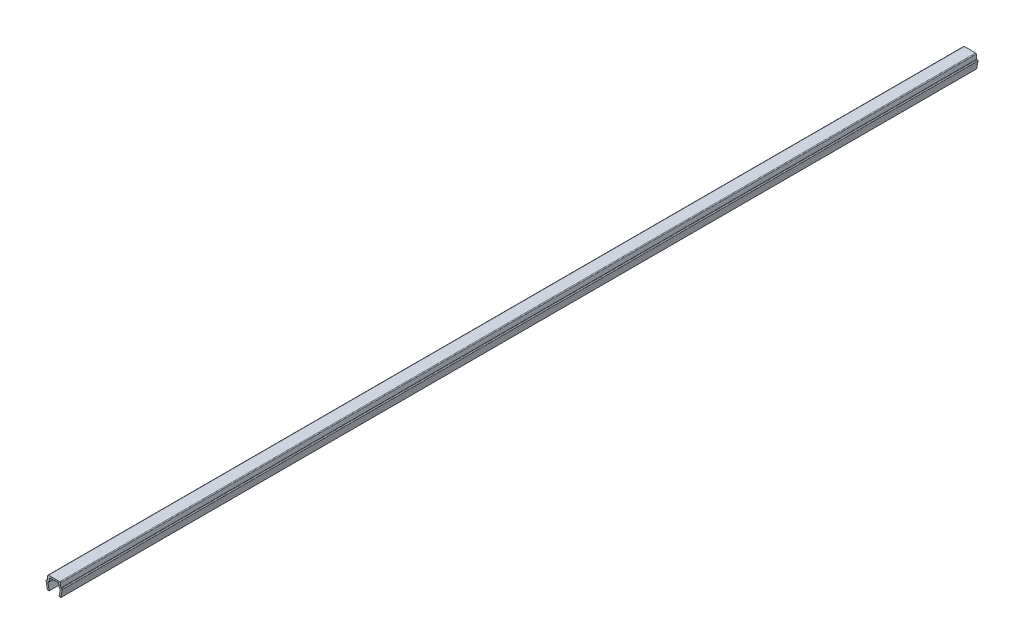
ISO-10303-21;
HEADER;
FILE_DESCRIPTION(('STEP AP214'),'2;1');
FILE_NAME('part.step','',(''),(''),'','','');
FILE_SCHEMA(('AUTOMOTIVE_DESIGN { 1 0 10303 214 1 1 1 1 }'));
ENDSEC;
DATA;
#1=APPLICATION_CONTEXT('core data for automotive mechanical design processes');
#2=APPLICATION_PROTOCOL_DEFINITION('international standard','automotive_design',2000,#1);
#3=PRODUCT_CONTEXT('',#1,'mechanical');
#4=PRODUCT('Part','Part','',(#3));
#5=PRODUCT_RELATED_PRODUCT_CATEGORY('part','',(#4));
#6=PRODUCT_DEFINITION_FORMATION('','',#4);
#7=PRODUCT_DEFINITION_CONTEXT('part definition',#1,'design');
#8=PRODUCT_DEFINITION('design','',#6,#7);
#9=PRODUCT_DEFINITION_SHAPE('','',#8);
#10=(LENGTH_UNIT() NAMED_UNIT(*) SI_UNIT(.MILLI.,.METRE.));
#11=(NAMED_UNIT(*) PLANE_ANGLE_UNIT() SI_UNIT($,.RADIAN.));
#12=(NAMED_UNIT(*) SI_UNIT($,.STERADIAN.) SOLID_ANGLE_UNIT());
#13=UNCERTAINTY_MEASURE_WITH_UNIT(LENGTH_MEASURE(1.E-05),#10,'distance_accuracy_value','');
#14=(GEOMETRIC_REPRESENTATION_CONTEXT(3) GLOBAL_UNCERTAINTY_ASSIGNED_CONTEXT((#13)) GLOBAL_UNIT_ASSIGNED_CONTEXT((#10,
#11,#12)) REPRESENTATION_CONTEXT('',''));
#15=CARTESIAN_POINT('',(0.,0.,0.));
#16=DIRECTION('',(0.,0.,1.));
#17=DIRECTION('',(1.,0.,0.));
#18=AXIS2_PLACEMENT_3D('',#15,#16,#17);
#19=CARTESIAN_POINT('',(-3.25000000000003,3.35000000000003,203.75));
#20=DIRECTION('',(0.,0.,-1.));
#21=DIRECTION('',(-1.,0.,0.));
#22=AXIS2_PLACEMENT_3D('',#19,#20,#21);
#23=CYLINDRICAL_SURFACE('',#22,0.349999999999972);
#24=DIRECTION('',(0.,0.,-1.));
#25=VECTOR('',#24,1.);
#26=CARTESIAN_POINT('',(-3.25,3.7,203.75));
#27=LINE('',#26,#25);
#28=CARTESIAN_POINT('',(-3.25,3.7,203.75));
#29=VERTEX_POINT('',#28);
#30=CARTESIAN_POINT('',(-3.25,3.7,-203.75));
#31=VERTEX_POINT('',#30);
#32=EDGE_CURVE('E211',#29,#31,#27,.T.);
#33=ORIENTED_EDGE('',*,*,#32,.T.);
#34=CARTESIAN_POINT('',(-3.25000000000003,3.35000000000003,-203.75));
#35=DIRECTION('',(0.,0.,1.));
#36=DIRECTION('',(1.,0.,0.));
#37=AXIS2_PLACEMENT_3D('',#34,#35,#36);
#38=CIRCLE('',#37,0.349999999999972);
#39=CARTESIAN_POINT('',(-3.6,3.35,-203.75));
#40=VERTEX_POINT('',#39);
#41=EDGE_CURVE('E205',#31,#40,#38,.T.);
#42=ORIENTED_EDGE('',*,*,#41,.T.);
#43=DIRECTION('',(0.,0.,-1.));
#44=VECTOR('',#43,1.);
#45=CARTESIAN_POINT('',(-3.6,3.35,203.75));
#46=LINE('',#45,#44);
#47=CARTESIAN_POINT('',(-3.6,3.35,203.75));
#48=VERTEX_POINT('',#47);
#49=EDGE_CURVE('E11',#48,#40,#46,.T.);
#50=ORIENTED_EDGE('',*,*,#49,.F.);
#51=CARTESIAN_POINT('',(-3.25000000000003,3.35000000000003,203.75));
#52=DIRECTION('',(0.,0.,1.));
#53=DIRECTION('',(1.,0.,0.));
#54=AXIS2_PLACEMENT_3D('',#51,#52,#53);
#55=CIRCLE('',#54,0.349999999999972);
#56=EDGE_CURVE('E277',#29,#48,#55,.T.);
#57=ORIENTED_EDGE('',*,*,#56,.F.);
#58=EDGE_LOOP('',(#33,#42,#50,#57));
#59=FACE_BOUND('',#58,.T.);
#60=ADVANCED_FACE('F33',(#59),#23,.T.);
#61=CARTESIAN_POINT('',(-3.6,3.35,203.75));
#62=DIRECTION('',(0.984336643247304,0.176299100283099,0.));
#63=DIRECTION('',(-0.176299100283099,0.984336643247304,0.));
#64=AXIS2_PLACEMENT_3D('',#61,#62,#63);
#65=PLANE('',#64);
#66=ORIENTED_EDGE('',*,*,#49,.T.);
#67=DIRECTION('',(0.176299100283099,-0.984336643247304,0.));
#68=VECTOR('',#67,1.);
#69=CARTESIAN_POINT('',(-3.6,3.35,-203.75));
#70=LINE('',#69,#68);
#71=CARTESIAN_POINT('',(-3.,0.,-203.75));
#72=VERTEX_POINT('',#71);
#73=EDGE_CURVE('E195',#40,#72,#70,.T.);
#74=ORIENTED_EDGE('',*,*,#73,.T.);
#75=DIRECTION('',(0.,0.,-1.));
#76=VECTOR('',#75,1.);
#77=CARTESIAN_POINT('',(-3.,0.,203.75));
#78=LINE('',#77,#76);
#79=CARTESIAN_POINT('',(-3.,0.,203.75));
#80=VERTEX_POINT('',#79);
#81=EDGE_CURVE('E40',#80,#72,#78,.T.);
#82=ORIENTED_EDGE('',*,*,#81,.F.);
#83=DIRECTION('',(0.176299100283099,-0.984336643247304,0.));
#84=VECTOR('',#83,1.);
#85=CARTESIAN_POINT('',(-3.6,3.35,203.75));
#86=LINE('',#85,#84);
#87=EDGE_CURVE('E196',#48,#80,#86,.T.);
#88=ORIENTED_EDGE('',*,*,#87,.F.);
#89=EDGE_LOOP('',(#66,#74,#82,#88));
#90=FACE_BOUND('',#89,.T.);
#91=ADVANCED_FACE('F193',(#90),#65,.F.);
#92=CARTESIAN_POINT('',(-3.,0.,203.75));
#93=DIRECTION('',(0.,1.,0.));
#94=DIRECTION('',(0.,0.,1.));
#95=AXIS2_PLACEMENT_3D('',#92,#93,#94);
#96=PLANE('',#95);
#97=ORIENTED_EDGE('',*,*,#81,.T.);
#98=DIRECTION('',(1.,0.,0.));
#99=VECTOR('',#98,1.);
#100=CARTESIAN_POINT('',(-3.,0.,-203.75));
#101=LINE('',#100,#99);
#102=CARTESIAN_POINT('',(-2.2,0.,-203.75));
#103=VERTEX_POINT('',#102);
#104=EDGE_CURVE('E209',#72,#103,#101,.T.);
#105=ORIENTED_EDGE('',*,*,#104,.T.);
#106=DIRECTION('',(0.,0.,-1.));
#107=VECTOR('',#106,1.);
#108=CARTESIAN_POINT('',(-2.2,0.,203.75));
#109=LINE('',#108,#107);
#110=CARTESIAN_POINT('',(-2.2,0.,203.75));
#111=VERTEX_POINT('',#110);
#112=EDGE_CURVE('E363',#111,#103,#109,.T.);
#113=ORIENTED_EDGE('',*,*,#112,.F.);
#114=DIRECTION('',(1.,0.,0.));
#115=VECTOR('',#114,1.);
#116=CARTESIAN_POINT('',(-3.,0.,203.75));
#117=LINE('',#116,#115);
#118=EDGE_CURVE('E280',#80,#111,#117,.T.);
#119=ORIENTED_EDGE('',*,*,#118,.F.);
#120=EDGE_LOOP('',(#97,#105,#113,#119));
#121=FACE_BOUND('',#120,.T.);
#122=ADVANCED_FACE('F366',(#121),#96,.F.);
#123=CARTESIAN_POINT('',(-2.2,0.,203.75));
#124=DIRECTION('',(-0.984336643247306,-0.176299100283088,0.));
#125=DIRECTION('',(0.176299100283088,-0.984336643247306,0.));
#126=AXIS2_PLACEMENT_3D('',#123,#124,#125);
#127=PLANE('',#126);
#128=ORIENTED_EDGE('',*,*,#112,.T.);
#129=DIRECTION('',(-0.176299100283088,0.984336643247306,0.));
#130=VECTOR('',#129,1.);
#131=CARTESIAN_POINT('',(-2.2,0.,-203.75));
#132=LINE('',#131,#130);
#133=CARTESIAN_POINT('',(-2.7352170713255,2.9882953149009,-203.75));
#134=VERTEX_POINT('',#133);
#135=EDGE_CURVE('E215',#103,#134,#132,.T.);
#136=ORIENTED_EDGE('',*,*,#135,.T.);
#137=DIRECTION('',(0.,0.,-1.));
#138=VECTOR('',#137,1.);
#139=CARTESIAN_POINT('',(-2.7352170713255,2.9882953149009,203.75));
#140=LINE('',#139,#138);
#141=CARTESIAN_POINT('',(-2.7352170713255,2.9882953149009,203.75));
#142=VERTEX_POINT('',#141);
#143=EDGE_CURVE('E361',#142,#134,#140,.T.);
#144=ORIENTED_EDGE('',*,*,#143,.F.);
#145=DIRECTION('',(-0.176299100283088,0.984336643247306,0.));
#146=VECTOR('',#145,1.);
#147=CARTESIAN_POINT('',(-2.2,0.,203.75));
#148=LINE('',#147,#146);
#149=EDGE_CURVE('E282',#111,#142,#148,.T.);
#150=ORIENTED_EDGE('',*,*,#149,.F.);
#151=EDGE_LOOP('',(#128,#136,#144,#150));
#152=FACE_BOUND('',#151,.T.);
#153=ADVANCED_FACE('F374',(#152),#127,.F.);
#154=CARTESIAN_POINT('',(-2.390699246189,3.05000000000004,203.75));
#155=DIRECTION('',(0.,0.,-1.));
#156=DIRECTION('',(-1.,0.,0.));
#157=AXIS2_PLACEMENT_3D('',#154,#155,#156);
#158=CYLINDRICAL_SURFACE('',#157,0.349999999999955);
#159=ORIENTED_EDGE('',*,*,#143,.T.);
#160=CARTESIAN_POINT('',(-2.390699246189,3.05000000000004,-203.75));
#161=DIRECTION('',(0.,0.,-1.));
#162=DIRECTION('',(-1.,0.,0.));
#163=AXIS2_PLACEMENT_3D('',#160,#161,#162);
#164=CIRCLE('',#163,0.349999999999955);
#165=CARTESIAN_POINT('',(-2.390699246189,3.4,-203.75));
#166=VERTEX_POINT('',#165);
#167=EDGE_CURVE('E218',#134,#166,#164,.T.);
#168=ORIENTED_EDGE('',*,*,#167,.T.);
#169=DIRECTION('',(0.,0.,-1.));
#170=VECTOR('',#169,1.);
#171=CARTESIAN_POINT('',(-2.390699246189,3.4,203.75));
#172=LINE('',#171,#170);
#173=CARTESIAN_POINT('',(-2.390699246189,3.4,203.75));
#174=VERTEX_POINT('',#173);
#175=EDGE_CURVE('E359',#174,#166,#172,.T.);
#176=ORIENTED_EDGE('',*,*,#175,.F.);
#177=CARTESIAN_POINT('',(-2.390699246189,3.05000000000004,203.75));
#178=DIRECTION('',(0.,0.,-1.));
#179=DIRECTION('',(-1.,0.,0.));
#180=AXIS2_PLACEMENT_3D('',#177,#178,#179);
#181=CIRCLE('',#180,0.349999999999955);
#182=EDGE_CURVE('E284',#142,#174,#181,.T.);
#183=ORIENTED_EDGE('',*,*,#182,.F.);
#184=EDGE_LOOP('',(#159,#168,#176,#183));
#185=FACE_BOUND('',#184,.T.);
#186=ADVANCED_FACE('F377',(#185),#158,.F.);
#187=CARTESIAN_POINT('',(-2.390699246189,3.4,203.75));
#188=DIRECTION('',(0.,1.,0.));
#189=DIRECTION('',(0.,0.,1.));
#190=AXIS2_PLACEMENT_3D('',#187,#188,#189);
#191=PLANE('',#190);
#192=ORIENTED_EDGE('',*,*,#175,.T.);
#193=DIRECTION('',(1.,0.,0.));
#194=VECTOR('',#193,1.);
#195=CARTESIAN_POINT('',(-2.390699246189,3.4,-203.75));
#196=LINE('',#195,#194);
#197=CARTESIAN_POINT('',(-2.2,3.4,-203.75));
#198=VERTEX_POINT('',#197);
#199=EDGE_CURVE('E221',#166,#198,#196,.T.);
#200=ORIENTED_EDGE('',*,*,#199,.T.);
#201=DIRECTION('',(0.,0.,-1.));
#202=VECTOR('',#201,1.);
#203=CARTESIAN_POINT('',(-2.2,3.4,203.75));
#204=LINE('',#203,#202);
#205=CARTESIAN_POINT('',(-2.2,3.4,203.75));
#206=VERTEX_POINT('',#205);
#207=EDGE_CURVE('E357',#206,#198,#204,.T.);
#208=ORIENTED_EDGE('',*,*,#207,.F.);
#209=DIRECTION('',(1.,0.,0.));
#210=VECTOR('',#209,1.);
#211=CARTESIAN_POINT('',(-2.390699246189,3.4,203.75));
#212=LINE('',#211,#210);
#213=EDGE_CURVE('E286',#174,#206,#212,.T.);
#214=ORIENTED_EDGE('',*,*,#213,.F.);
#215=EDGE_LOOP('',(#192,#200,#208,#214));
#216=FACE_BOUND('',#215,.T.);
#217=ADVANCED_FACE('F382',(#216),#191,.F.);
#218=CARTESIAN_POINT('',(-2.2,3.4,203.75));
#219=DIRECTION('',(-0.996194698091743,0.08715574274769,0.));
#220=DIRECTION('',(-0.08715574274769,-0.996194698091743,0.));
#221=AXIS2_PLACEMENT_3D('',#218,#219,#220);
#222=PLANE('',#221);
#223=ORIENTED_EDGE('',*,*,#207,.T.);
#224=DIRECTION('',(0.08715574274769,0.996194698091743,0.));
#225=VECTOR('',#224,1.);
#226=CARTESIAN_POINT('',(-2.2,3.4,-203.75));
#227=LINE('',#226,#225);
#228=CARTESIAN_POINT('',(-2.0704726390793,4.8805045099617,-203.75));
#229=VERTEX_POINT('',#228);
#230=EDGE_CURVE('E224',#198,#229,#227,.T.);
#231=ORIENTED_EDGE('',*,*,#230,.T.);
#232=DIRECTION('',(0.,0.,-1.));
#233=VECTOR('',#232,1.);
#234=CARTESIAN_POINT('',(-2.0704726390793,4.8805045099617,203.75));
#235=LINE('',#234,#233);
#236=CARTESIAN_POINT('',(-2.0704726390793,4.8805045099617,203.75));
#237=VERTEX_POINT('',#236);
#238=EDGE_CURVE('E355',#237,#229,#235,.T.);
#239=ORIENTED_EDGE('',*,*,#238,.F.);
#240=DIRECTION('',(0.08715574274769,0.996194698091743,0.));
#241=VECTOR('',#240,1.);
#242=CARTESIAN_POINT('',(-2.2,3.4,203.75));
#243=LINE('',#242,#241);
#244=EDGE_CURVE('E288',#206,#237,#243,.T.);
#245=ORIENTED_EDGE('',*,*,#244,.F.);
#246=EDGE_LOOP('',(#223,#231,#239,#245));
#247=FACE_BOUND('',#246,.T.);
#248=ADVANCED_FACE('F388',(#247),#222,.F.);
#249=CARTESIAN_POINT('',(-1.72180449474716,4.84999999999996,203.75));
#250=DIRECTION('',(0.,0.,-1.));
#251=DIRECTION('',(-1.,0.,0.));
#252=AXIS2_PLACEMENT_3D('',#249,#250,#251);
#253=CYLINDRICAL_SURFACE('',#252,0.350000000000036);
#254=ORIENTED_EDGE('',*,*,#238,.T.);
#255=CARTESIAN_POINT('',(-1.72180449474716,4.84999999999996,-203.75));
#256=DIRECTION('',(0.,0.,-1.));
#257=DIRECTION('',(-1.,0.,0.));
#258=AXIS2_PLACEMENT_3D('',#255,#256,#257);
#259=CIRCLE('',#258,0.350000000000036);
#260=CARTESIAN_POINT('',(-1.7218044947472,5.2,-203.75));
#261=VERTEX_POINT('',#260);
#262=EDGE_CURVE('E227',#229,#261,#259,.T.);
#263=ORIENTED_EDGE('',*,*,#262,.T.);
#264=DIRECTION('',(0.,0.,-1.));
#265=VECTOR('',#264,1.);
#266=CARTESIAN_POINT('',(-1.7218044947472,5.2,203.75));
#267=LINE('',#266,#265);
#268=CARTESIAN_POINT('',(-1.7218044947472,5.2,203.75));
#269=VERTEX_POINT('',#268);
#270=EDGE_CURVE('E353',#269,#261,#267,.T.);
#271=ORIENTED_EDGE('',*,*,#270,.F.);
#272=CARTESIAN_POINT('',(-1.72180449474716,4.84999999999996,203.75));
#273=DIRECTION('',(0.,0.,-1.));
#274=DIRECTION('',(-1.,0.,0.));
#275=AXIS2_PLACEMENT_3D('',#272,#273,#274);
#276=CIRCLE('',#275,0.350000000000036);
#277=EDGE_CURVE('E290',#237,#269,#276,.T.);
#278=ORIENTED_EDGE('',*,*,#277,.F.);
#279=EDGE_LOOP('',(#254,#263,#271,#278));
#280=FACE_BOUND('',#279,.T.);
#281=ADVANCED_FACE('F392',(#280),#253,.F.);
#282=CARTESIAN_POINT('',(-1.7218044947472,5.2,203.75));
#283=DIRECTION('',(0.,1.,0.));
#284=DIRECTION('',(0.,0.,1.));
#285=AXIS2_PLACEMENT_3D('',#282,#283,#284);
#286=PLANE('',#285);
#287=ORIENTED_EDGE('',*,*,#270,.T.);
#288=DIRECTION('',(1.,0.,0.));
#289=VECTOR('',#288,1.);
#290=CARTESIAN_POINT('',(-1.7218044947472,5.2,-203.75));
#291=LINE('',#290,#289);
#292=CARTESIAN_POINT('',(1.7218044947472,5.2,-203.75));
#293=VERTEX_POINT('',#292);
#294=EDGE_CURVE('E230',#261,#293,#291,.T.);
#295=ORIENTED_EDGE('',*,*,#294,.T.);
#296=DIRECTION('',(0.,0.,-1.));
#297=VECTOR('',#296,1.);
#298=CARTESIAN_POINT('',(1.7218044947472,5.2,203.75));
#299=LINE('',#298,#297);
#300=CARTESIAN_POINT('',(1.7218044947472,5.2,203.75));
#301=VERTEX_POINT('',#300);
#302=EDGE_CURVE('E351',#301,#293,#299,.T.);
#303=ORIENTED_EDGE('',*,*,#302,.F.);
#304=DIRECTION('',(1.,0.,0.));
#305=VECTOR('',#304,1.);
#306=CARTESIAN_POINT('',(-1.7218044947472,5.2,203.75));
#307=LINE('',#306,#305);
#308=EDGE_CURVE('E292',#269,#301,#307,.T.);
#309=ORIENTED_EDGE('',*,*,#308,.F.);
#310=EDGE_LOOP('',(#287,#295,#303,#309));
#311=FACE_BOUND('',#310,.T.);
#312=ADVANCED_FACE('F397',(#311),#286,.F.);
#313=CARTESIAN_POINT('',(1.72180449474716,4.84999999999996,203.75));
#314=DIRECTION('',(0.,0.,-1.));
#315=DIRECTION('',(-1.,0.,0.));
#316=AXIS2_PLACEMENT_3D('',#313,#314,#315);
#317=CYLINDRICAL_SURFACE('',#316,0.350000000000036);
#318=ORIENTED_EDGE('',*,*,#302,.T.);
#319=CARTESIAN_POINT('',(1.72180449474716,4.84999999999996,-203.75));
#320=DIRECTION('',(0.,0.,-1.));
#321=DIRECTION('',(-1.,0.,0.));
#322=AXIS2_PLACEMENT_3D('',#319,#320,#321);
#323=CIRCLE('',#322,0.350000000000036);
#324=CARTESIAN_POINT('',(2.0704726390793,4.8805045099617,-203.75));
#325=VERTEX_POINT('',#324);
#326=EDGE_CURVE('E233',#293,#325,#323,.T.);
#327=ORIENTED_EDGE('',*,*,#326,.T.);
#328=DIRECTION('',(0.,0.,-1.));
#329=VECTOR('',#328,1.);
#330=CARTESIAN_POINT('',(2.0704726390793,4.8805045099617,203.75));
#331=LINE('',#330,#329);
#332=CARTESIAN_POINT('',(2.0704726390793,4.8805045099617,203.75));
#333=VERTEX_POINT('',#332);
#334=EDGE_CURVE('E349',#333,#325,#331,.T.);
#335=ORIENTED_EDGE('',*,*,#334,.F.);
#336=CARTESIAN_POINT('',(1.72180449474716,4.84999999999996,203.75));
#337=DIRECTION('',(0.,0.,-1.));
#338=DIRECTION('',(-1.,0.,0.));
#339=AXIS2_PLACEMENT_3D('',#336,#337,#338);
#340=CIRCLE('',#339,0.350000000000036);
#341=EDGE_CURVE('E294',#301,#333,#340,.T.);
#342=ORIENTED_EDGE('',*,*,#341,.F.);
#343=EDGE_LOOP('',(#318,#327,#335,#342));
#344=FACE_BOUND('',#343,.T.);
#345=ADVANCED_FACE('F403',(#344),#317,.F.);
#346=CARTESIAN_POINT('',(2.0704726390793,4.8805045099617,203.75));
#347=DIRECTION('',(0.996194698091743,0.08715574274769,0.));
#348=DIRECTION('',(-0.08715574274769,0.996194698091743,0.));
#349=AXIS2_PLACEMENT_3D('',#346,#347,#348);
#350=PLANE('',#349);
#351=ORIENTED_EDGE('',*,*,#334,.T.);
#352=DIRECTION('',(0.08715574274769,-0.996194698091743,0.));
#353=VECTOR('',#352,1.);
#354=CARTESIAN_POINT('',(2.0704726390793,4.8805045099617,-203.75));
#355=LINE('',#354,#353);
#356=CARTESIAN_POINT('',(2.2,3.4,-203.75));
#357=VERTEX_POINT('',#356);
#358=EDGE_CURVE('E236',#325,#357,#355,.T.);
#359=ORIENTED_EDGE('',*,*,#358,.T.);
#360=DIRECTION('',(0.,0.,-1.));
#361=VECTOR('',#360,1.);
#362=CARTESIAN_POINT('',(2.2,3.4,203.75));
#363=LINE('',#362,#361);
#364=CARTESIAN_POINT('',(2.2,3.4,203.75));
#365=VERTEX_POINT('',#364);
#366=EDGE_CURVE('E347',#365,#357,#363,.T.);
#367=ORIENTED_EDGE('',*,*,#366,.F.);
#368=DIRECTION('',(0.08715574274769,-0.996194698091743,0.));
#369=VECTOR('',#368,1.);
#370=CARTESIAN_POINT('',(2.0704726390793,4.8805045099617,203.75));
#371=LINE('',#370,#369);
#372=EDGE_CURVE('E296',#333,#365,#371,.T.);
#373=ORIENTED_EDGE('',*,*,#372,.F.);
#374=EDGE_LOOP('',(#351,#359,#367,#373));
#375=FACE_BOUND('',#374,.T.);
#376=ADVANCED_FACE('F407',(#375),#350,.F.);
#377=CARTESIAN_POINT('',(2.2,3.4,203.75));
#378=DIRECTION('',(0.,1.,0.));
#379=DIRECTION('',(0.,0.,1.));
#380=AXIS2_PLACEMENT_3D('',#377,#378,#379);
#381=PLANE('',#380);
#382=ORIENTED_EDGE('',*,*,#366,.T.);
#383=DIRECTION('',(1.,0.,0.));
#384=VECTOR('',#383,1.);
#385=CARTESIAN_POINT('',(2.2,3.4,-203.75));
#386=LINE('',#385,#384);
#387=CARTESIAN_POINT('',(2.390699246189,3.4,-203.75));
#388=VERTEX_POINT('',#387);
#389=EDGE_CURVE('E239',#357,#388,#386,.T.);
#390=ORIENTED_EDGE('',*,*,#389,.T.);
#391=DIRECTION('',(0.,0.,-1.));
#392=VECTOR('',#391,1.);
#393=CARTESIAN_POINT('',(2.390699246189,3.4,203.75));
#394=LINE('',#393,#392);
#395=CARTESIAN_POINT('',(2.390699246189,3.4,203.75));
#396=VERTEX_POINT('',#395);
#397=EDGE_CURVE('E345',#396,#388,#394,.T.);
#398=ORIENTED_EDGE('',*,*,#397,.F.);
#399=DIRECTION('',(1.,0.,0.));
#400=VECTOR('',#399,1.);
#401=CARTESIAN_POINT('',(2.2,3.4,203.75));
#402=LINE('',#401,#400);
#403=EDGE_CURVE('E298',#365,#396,#402,.T.);
#404=ORIENTED_EDGE('',*,*,#403,.F.);
#405=EDGE_LOOP('',(#382,#390,#398,#404));
#406=FACE_BOUND('',#405,.T.);
#407=ADVANCED_FACE('F412',(#406),#381,.F.);
#408=CARTESIAN_POINT('',(2.390699246189,3.05000000000004,203.75));
#409=DIRECTION('',(0.,0.,-1.));
#410=DIRECTION('',(-1.,0.,0.));
#411=AXIS2_PLACEMENT_3D('',#408,#409,#410);
#412=CYLINDRICAL_SURFACE('',#411,0.349999999999955);
#413=ORIENTED_EDGE('',*,*,#397,.T.);
#414=CARTESIAN_POINT('',(2.390699246189,3.05000000000004,-203.75));
#415=DIRECTION('',(0.,0.,-1.));
#416=DIRECTION('',(-1.,0.,0.));
#417=AXIS2_PLACEMENT_3D('',#414,#415,#416);
#418=CIRCLE('',#417,0.349999999999955);
#419=CARTESIAN_POINT('',(2.7352170713255,2.9882953149009,-203.75));
#420=VERTEX_POINT('',#419);
#421=EDGE_CURVE('E242',#388,#420,#418,.T.);
#422=ORIENTED_EDGE('',*,*,#421,.T.);
#423=DIRECTION('',(0.,0.,-1.));
#424=VECTOR('',#423,1.);
#425=CARTESIAN_POINT('',(2.7352170713255,2.9882953149009,203.75));
#426=LINE('',#425,#424);
#427=CARTESIAN_POINT('',(2.7352170713255,2.9882953149009,203.75));
#428=VERTEX_POINT('',#427);
#429=EDGE_CURVE('E343',#428,#420,#426,.T.);
#430=ORIENTED_EDGE('',*,*,#429,.F.);
#431=CARTESIAN_POINT('',(2.390699246189,3.05000000000004,203.75));
#432=DIRECTION('',(0.,0.,-1.));
#433=DIRECTION('',(-1.,0.,0.));
#434=AXIS2_PLACEMENT_3D('',#431,#432,#433);
#435=CIRCLE('',#434,0.349999999999955);
#436=EDGE_CURVE('E300',#396,#428,#435,.T.);
#437=ORIENTED_EDGE('',*,*,#436,.F.);
#438=EDGE_LOOP('',(#413,#422,#430,#437));
#439=FACE_BOUND('',#438,.T.);
#440=ADVANCED_FACE('F418',(#439),#412,.F.);
#441=CARTESIAN_POINT('',(2.7352170713255,2.9882953149009,203.75));
#442=DIRECTION('',(0.984336643247306,-0.176299100283088,0.));
#443=DIRECTION('',(0.176299100283088,0.984336643247306,0.));
#444=AXIS2_PLACEMENT_3D('',#441,#442,#443);
#445=PLANE('',#444);
#446=ORIENTED_EDGE('',*,*,#429,.T.);
#447=DIRECTION('',(-0.176299100283088,-0.984336643247306,0.));
#448=VECTOR('',#447,1.);
#449=CARTESIAN_POINT('',(2.7352170713255,2.9882953149009,-203.75));
#450=LINE('',#449,#448);
#451=CARTESIAN_POINT('',(2.2,0.,-203.75));
#452=VERTEX_POINT('',#451);
#453=EDGE_CURVE('E245',#420,#452,#450,.T.);
#454=ORIENTED_EDGE('',*,*,#453,.T.);
#455=DIRECTION('',(0.,0.,-1.));
#456=VECTOR('',#455,1.);
#457=CARTESIAN_POINT('',(2.2,0.,203.75));
#458=LINE('',#457,#456);
#459=CARTESIAN_POINT('',(2.2,0.,203.75));
#460=VERTEX_POINT('',#459);
#461=EDGE_CURVE('E341',#460,#452,#458,.T.);
#462=ORIENTED_EDGE('',*,*,#461,.F.);
#463=DIRECTION('',(-0.176299100283088,-0.984336643247306,0.));
#464=VECTOR('',#463,1.);
#465=CARTESIAN_POINT('',(2.7352170713255,2.9882953149009,203.75));
#466=LINE('',#465,#464);
#467=EDGE_CURVE('E302',#428,#460,#466,.T.);
#468=ORIENTED_EDGE('',*,*,#467,.F.);
#469=EDGE_LOOP('',(#446,#454,#462,#468));
#470=FACE_BOUND('',#469,.T.);
#471=ADVANCED_FACE('F422',(#470),#445,.F.);
#472=CARTESIAN_POINT('',(2.2,0.,203.75));
#473=DIRECTION('',(0.,1.,0.));
#474=DIRECTION('',(0.,0.,1.));
#475=AXIS2_PLACEMENT_3D('',#472,#473,#474);
#476=PLANE('',#475);
#477=ORIENTED_EDGE('',*,*,#461,.T.);
#478=DIRECTION('',(1.,0.,0.));
#479=VECTOR('',#478,1.);
#480=CARTESIAN_POINT('',(2.2,0.,-203.75));
#481=LINE('',#480,#479);
#482=CARTESIAN_POINT('',(3.,0.,-203.75));
#483=VERTEX_POINT('',#482);
#484=EDGE_CURVE('E248',#452,#483,#481,.T.);
#485=ORIENTED_EDGE('',*,*,#484,.T.);
#486=DIRECTION('',(0.,0.,-1.));
#487=VECTOR('',#486,1.);
#488=CARTESIAN_POINT('',(3.,0.,203.75));
#489=LINE('',#488,#487);
#490=CARTESIAN_POINT('',(3.,0.,203.75));
#491=VERTEX_POINT('',#490);
#492=EDGE_CURVE('E339',#491,#483,#489,.T.);
#493=ORIENTED_EDGE('',*,*,#492,.F.);
#494=DIRECTION('',(1.,0.,0.));
#495=VECTOR('',#494,1.);
#496=CARTESIAN_POINT('',(2.2,0.,203.75));
#497=LINE('',#496,#495);
#498=EDGE_CURVE('E304',#460,#491,#497,.T.);
#499=ORIENTED_EDGE('',*,*,#498,.F.);
#500=EDGE_LOOP('',(#477,#485,#493,#499));
#501=FACE_BOUND('',#500,.T.);
#502=ADVANCED_FACE('F427',(#501),#476,.F.);
#503=CARTESIAN_POINT('',(3.,0.,203.75));
#504=DIRECTION('',(-0.984336643247304,0.176299100283099,0.));
#505=DIRECTION('',(-0.176299100283099,-0.984336643247304,0.));
#506=AXIS2_PLACEMENT_3D('',#503,#504,#505);
#507=PLANE('',#506);
#508=ORIENTED_EDGE('',*,*,#492,.T.);
#509=DIRECTION('',(0.176299100283099,0.984336643247304,0.));
#510=VECTOR('',#509,1.);
#511=CARTESIAN_POINT('',(3.,0.,-203.75));
#512=LINE('',#511,#510);
#513=CARTESIAN_POINT('',(3.6,3.35,-203.75));
#514=VERTEX_POINT('',#513);
#515=EDGE_CURVE('E251',#483,#514,#512,.T.);
#516=ORIENTED_EDGE('',*,*,#515,.T.);
#517=DIRECTION('',(0.,0.,-1.));
#518=VECTOR('',#517,1.);
#519=CARTESIAN_POINT('',(3.6,3.35,203.75));
#520=LINE('',#519,#518);
#521=CARTESIAN_POINT('',(3.6,3.35,203.75));
#522=VERTEX_POINT('',#521);
#523=EDGE_CURVE('E337',#522,#514,#520,.T.);
#524=ORIENTED_EDGE('',*,*,#523,.F.);
#525=DIRECTION('',(0.176299100283099,0.984336643247304,0.));
#526=VECTOR('',#525,1.);
#527=CARTESIAN_POINT('',(3.,0.,203.75));
#528=LINE('',#527,#526);
#529=EDGE_CURVE('E306',#491,#522,#528,.T.);
#530=ORIENTED_EDGE('',*,*,#529,.F.);
#531=EDGE_LOOP('',(#508,#516,#524,#530));
#532=FACE_BOUND('',#531,.T.);
#533=ADVANCED_FACE('F433',(#532),#507,.F.);
#534=CARTESIAN_POINT('',(3.25000000000003,3.35000000000003,203.75));
#535=DIRECTION('',(0.,0.,-1.));
#536=DIRECTION('',(-1.,0.,0.));
#537=AXIS2_PLACEMENT_3D('',#534,#535,#536);
#538=CYLINDRICAL_SURFACE('',#537,0.349999999999972);
#539=ORIENTED_EDGE('',*,*,#523,.T.);
#540=CARTESIAN_POINT('',(3.25000000000003,3.35000000000003,-203.75));
#541=DIRECTION('',(0.,0.,1.));
#542=DIRECTION('',(1.,0.,0.));
#543=AXIS2_PLACEMENT_3D('',#540,#541,#542);
#544=CIRCLE('',#543,0.349999999999972);
#545=CARTESIAN_POINT('',(3.25,3.7,-203.75));
#546=VERTEX_POINT('',#545);
#547=EDGE_CURVE('E254',#514,#546,#544,.T.);
#548=ORIENTED_EDGE('',*,*,#547,.T.);
#549=DIRECTION('',(0.,0.,-1.));
#550=VECTOR('',#549,1.);
#551=CARTESIAN_POINT('',(3.25,3.7,203.75));
#552=LINE('',#551,#550);
#553=CARTESIAN_POINT('',(3.25,3.7,203.75));
#554=VERTEX_POINT('',#553);
#555=EDGE_CURVE('E335',#554,#546,#552,.T.);
#556=ORIENTED_EDGE('',*,*,#555,.F.);
#557=CARTESIAN_POINT('',(3.25000000000003,3.35000000000003,203.75));
#558=DIRECTION('',(0.,0.,1.));
#559=DIRECTION('',(1.,0.,0.));
#560=AXIS2_PLACEMENT_3D('',#557,#558,#559);
#561=CIRCLE('',#560,0.349999999999972);
#562=EDGE_CURVE('E308',#522,#554,#561,.T.);
#563=ORIENTED_EDGE('',*,*,#562,.F.);
#564=EDGE_LOOP('',(#539,#548,#556,#563));
#565=FACE_BOUND('',#564,.T.);
#566=ADVANCED_FACE('F437',(#565),#538,.T.);
#567=CARTESIAN_POINT('',(3.25,3.7,203.75));
#568=DIRECTION('',(0.,-1.,0.));
#569=DIRECTION('',(0.,0.,-1.));
#570=AXIS2_PLACEMENT_3D('',#567,#568,#569);
#571=PLANE('',#570);
#572=ORIENTED_EDGE('',*,*,#555,.T.);
#573=DIRECTION('',(-1.,0.,0.));
#574=VECTOR('',#573,1.);
#575=CARTESIAN_POINT('',(3.25,3.7,-203.75));
#576=LINE('',#575,#574);
#577=CARTESIAN_POINT('',(3.,3.7,-203.75));
#578=VERTEX_POINT('',#577);
#579=EDGE_CURVE('E257',#546,#578,#576,.T.);
#580=ORIENTED_EDGE('',*,*,#579,.T.);
#581=DIRECTION('',(0.,0.,-1.));
#582=VECTOR('',#581,1.);
#583=CARTESIAN_POINT('',(3.,3.7,203.75));
#584=LINE('',#583,#582);
#585=CARTESIAN_POINT('',(3.,3.7,203.75));
#586=VERTEX_POINT('',#585);
#587=EDGE_CURVE('E333',#586,#578,#584,.T.);
#588=ORIENTED_EDGE('',*,*,#587,.F.);
#589=DIRECTION('',(-1.,0.,0.));
#590=VECTOR('',#589,1.);
#591=CARTESIAN_POINT('',(3.25,3.7,203.75));
#592=LINE('',#591,#590);
#593=EDGE_CURVE('E310',#554,#586,#592,.T.);
#594=ORIENTED_EDGE('',*,*,#593,.F.);
#595=EDGE_LOOP('',(#572,#580,#588,#594));
#596=FACE_BOUND('',#595,.T.);
#597=ADVANCED_FACE('F442',(#596),#571,.F.);
#598=CARTESIAN_POINT('',(3.,3.7,203.75));
#599=DIRECTION('',(-0.996194698091747,-0.0871557427476467,0.));
#600=DIRECTION('',(0.0871557427476467,-0.996194698091747,0.));
#601=AXIS2_PLACEMENT_3D('',#598,#599,#600);
#602=PLANE('',#601);
#603=ORIENTED_EDGE('',*,*,#587,.T.);
#604=DIRECTION('',(-0.0871557427476467,0.996194698091747,0.));
#605=VECTOR('',#604,1.);
#606=CARTESIAN_POINT('',(3.,3.7,-203.75));
#607=LINE('',#606,#605);
#608=CARTESIAN_POINT('',(2.835477173669,5.5805045099617,-203.75));
#609=VERTEX_POINT('',#608);
#610=EDGE_CURVE('E260',#578,#609,#607,.T.);
#611=ORIENTED_EDGE('',*,*,#610,.T.);
#612=DIRECTION('',(0.,0.,-1.));
#613=VECTOR('',#612,1.);
#614=CARTESIAN_POINT('',(2.835477173669,5.5805045099617,203.75));
#615=LINE('',#614,#613);
#616=CARTESIAN_POINT('',(2.835477173669,5.5805045099617,203.75));
#617=VERTEX_POINT('',#616);
#618=EDGE_CURVE('E331',#617,#609,#615,.T.);
#619=ORIENTED_EDGE('',*,*,#618,.F.);
#620=DIRECTION('',(-0.0871557427476467,0.996194698091747,0.));
#621=VECTOR('',#620,1.);
#622=CARTESIAN_POINT('',(3.,3.7,203.75));
#623=LINE('',#622,#621);
#624=EDGE_CURVE('E312',#586,#617,#623,.T.);
#625=ORIENTED_EDGE('',*,*,#624,.F.);
#626=EDGE_LOOP('',(#603,#611,#619,#625));
#627=FACE_BOUND('',#626,.T.);
#628=ADVANCED_FACE('F448',(#627),#602,.F.);
#629=CARTESIAN_POINT('',(2.48680902933686,5.54999999999996,203.75));
#630=DIRECTION('',(0.,0.,-1.));
#631=DIRECTION('',(-1.,0.,0.));
#632=AXIS2_PLACEMENT_3D('',#629,#630,#631);
#633=CYLINDRICAL_SURFACE('',#632,0.350000000000036);
#634=ORIENTED_EDGE('',*,*,#618,.T.);
#635=CARTESIAN_POINT('',(2.48680902933686,5.54999999999996,-203.75));
#636=DIRECTION('',(0.,0.,1.));
#637=DIRECTION('',(1.,0.,0.));
#638=AXIS2_PLACEMENT_3D('',#635,#636,#637);
#639=CIRCLE('',#638,0.350000000000036);
#640=CARTESIAN_POINT('',(2.4868090293369,5.9,-203.75));
#641=VERTEX_POINT('',#640);
#642=EDGE_CURVE('E263',#609,#641,#639,.T.);
#643=ORIENTED_EDGE('',*,*,#642,.T.);
#644=DIRECTION('',(0.,0.,-1.));
#645=VECTOR('',#644,1.);
#646=CARTESIAN_POINT('',(2.4868090293369,5.9,203.75));
#647=LINE('',#646,#645);
#648=CARTESIAN_POINT('',(2.4868090293369,5.9,203.75));
#649=VERTEX_POINT('',#648);
#650=EDGE_CURVE('E329',#649,#641,#647,.T.);
#651=ORIENTED_EDGE('',*,*,#650,.F.);
#652=CARTESIAN_POINT('',(2.48680902933686,5.54999999999996,203.75));
#653=DIRECTION('',(0.,0.,1.));
#654=DIRECTION('',(1.,0.,0.));
#655=AXIS2_PLACEMENT_3D('',#652,#653,#654);
#656=CIRCLE('',#655,0.350000000000036);
#657=EDGE_CURVE('E314',#617,#649,#656,.T.);
#658=ORIENTED_EDGE('',*,*,#657,.F.);
#659=EDGE_LOOP('',(#634,#643,#651,#658));
#660=FACE_BOUND('',#659,.T.);
#661=ADVANCED_FACE('F452',(#660),#633,.T.);
#662=CARTESIAN_POINT('',(2.4868090293369,5.9,203.75));
#663=DIRECTION('',(0.,-1.,0.));
#664=DIRECTION('',(0.,0.,-1.));
#665=AXIS2_PLACEMENT_3D('',#662,#663,#664);
#666=PLANE('',#665);
#667=ORIENTED_EDGE('',*,*,#650,.T.);
#668=DIRECTION('',(-1.,0.,0.));
#669=VECTOR('',#668,1.);
#670=CARTESIAN_POINT('',(2.4868090293369,5.9,-203.75));
#671=LINE('',#670,#669);
#672=CARTESIAN_POINT('',(-2.4868090293369,5.9,-203.75));
#673=VERTEX_POINT('',#672);
#674=EDGE_CURVE('E266',#641,#673,#671,.T.);
#675=ORIENTED_EDGE('',*,*,#674,.T.);
#676=DIRECTION('',(0.,0.,-1.));
#677=VECTOR('',#676,1.);
#678=CARTESIAN_POINT('',(-2.4868090293369,5.9,203.75));
#679=LINE('',#678,#677);
#680=CARTESIAN_POINT('',(-2.4868090293369,5.9,203.75));
#681=VERTEX_POINT('',#680);
#682=EDGE_CURVE('E327',#681,#673,#679,.T.);
#683=ORIENTED_EDGE('',*,*,#682,.F.);
#684=DIRECTION('',(-1.,0.,0.));
#685=VECTOR('',#684,1.);
#686=CARTESIAN_POINT('',(2.4868090293369,5.9,203.75));
#687=LINE('',#686,#685);
#688=EDGE_CURVE('E316',#649,#681,#687,.T.);
#689=ORIENTED_EDGE('',*,*,#688,.F.);
#690=EDGE_LOOP('',(#667,#675,#683,#689));
#691=FACE_BOUND('',#690,.T.);
#692=ADVANCED_FACE('F457',(#691),#666,.F.);
#693=CARTESIAN_POINT('',(-2.48680902933686,5.54999999999996,203.75));
#694=DIRECTION('',(0.,0.,-1.));
#695=DIRECTION('',(-1.,0.,0.));
#696=AXIS2_PLACEMENT_3D('',#693,#694,#695);
#697=CYLINDRICAL_SURFACE('',#696,0.350000000000036);
#698=ORIENTED_EDGE('',*,*,#682,.T.);
#699=CARTESIAN_POINT('',(-2.48680902933686,5.54999999999996,-203.75));
#700=DIRECTION('',(0.,0.,1.));
#701=DIRECTION('',(1.,0.,0.));
#702=AXIS2_PLACEMENT_3D('',#699,#700,#701);
#703=CIRCLE('',#702,0.350000000000036);
#704=CARTESIAN_POINT('',(-2.835477173669,5.5805045099617,-203.75));
#705=VERTEX_POINT('',#704);
#706=EDGE_CURVE('E269',#673,#705,#703,.T.);
#707=ORIENTED_EDGE('',*,*,#706,.T.);
#708=DIRECTION('',(0.,0.,-1.));
#709=VECTOR('',#708,1.);
#710=CARTESIAN_POINT('',(-2.835477173669,5.5805045099617,203.75));
#711=LINE('',#710,#709);
#712=CARTESIAN_POINT('',(-2.835477173669,5.5805045099617,203.75));
#713=VERTEX_POINT('',#712);
#714=EDGE_CURVE('E325',#713,#705,#711,.T.);
#715=ORIENTED_EDGE('',*,*,#714,.F.);
#716=CARTESIAN_POINT('',(-2.48680902933686,5.54999999999996,203.75));
#717=DIRECTION('',(0.,0.,1.));
#718=DIRECTION('',(1.,0.,0.));
#719=AXIS2_PLACEMENT_3D('',#716,#717,#718);
#720=CIRCLE('',#719,0.350000000000036);
#721=EDGE_CURVE('E318',#681,#713,#720,.T.);
#722=ORIENTED_EDGE('',*,*,#721,.F.);
#723=EDGE_LOOP('',(#698,#707,#715,#722));
#724=FACE_BOUND('',#723,.T.);
#725=ADVANCED_FACE('F461',(#724),#697,.T.);
#726=CARTESIAN_POINT('',(-2.835477173669,5.5805045099617,203.75));
#727=DIRECTION('',(0.996194698091747,-0.0871557427476467,0.));
#728=DIRECTION('',(0.0871557427476467,0.996194698091747,0.));
#729=AXIS2_PLACEMENT_3D('',#726,#727,#728);
#730=PLANE('',#729);
#731=ORIENTED_EDGE('',*,*,#714,.T.);
#732=DIRECTION('',(-0.0871557427476467,-0.996194698091747,0.));
#733=VECTOR('',#732,1.);
#734=CARTESIAN_POINT('',(-2.835477173669,5.5805045099617,-203.75));
#735=LINE('',#734,#733);
#736=CARTESIAN_POINT('',(-3.,3.7,-203.75));
#737=VERTEX_POINT('',#736);
#738=EDGE_CURVE('E272',#705,#737,#735,.T.);
#739=ORIENTED_EDGE('',*,*,#738,.T.);
#740=DIRECTION('',(0.,0.,-1.));
#741=VECTOR('',#740,1.);
#742=CARTESIAN_POINT('',(-3.,3.7,203.75));
#743=LINE('',#742,#741);
#744=CARTESIAN_POINT('',(-3.,3.7,203.75));
#745=VERTEX_POINT('',#744);
#746=EDGE_CURVE('E323',#745,#737,#743,.T.);
#747=ORIENTED_EDGE('',*,*,#746,.F.);
#748=DIRECTION('',(-0.0871557427476467,-0.996194698091747,0.));
#749=VECTOR('',#748,1.);
#750=CARTESIAN_POINT('',(-2.835477173669,5.5805045099617,203.75));
#751=LINE('',#750,#749);
#752=EDGE_CURVE('E52',#713,#745,#751,.T.);
#753=ORIENTED_EDGE('',*,*,#752,.F.);
#754=EDGE_LOOP('',(#731,#739,#747,#753));
#755=FACE_BOUND('',#754,.T.);
#756=ADVANCED_FACE('F465',(#755),#730,.F.);
#757=CARTESIAN_POINT('',(-3.,3.7,203.75));
#758=DIRECTION('',(0.,-1.,0.));
#759=DIRECTION('',(0.,0.,-1.));
#760=AXIS2_PLACEMENT_3D('',#757,#758,#759);
#761=PLANE('',#760);
#762=ORIENTED_EDGE('',*,*,#746,.T.);
#763=DIRECTION('',(-1.,0.,0.));
#764=VECTOR('',#763,1.);
#765=CARTESIAN_POINT('',(-3.,3.7,-203.75));
#766=LINE('',#765,#764);
#767=EDGE_CURVE('E275',#737,#31,#766,.T.);
#768=ORIENTED_EDGE('',*,*,#767,.T.);
#769=ORIENTED_EDGE('',*,*,#32,.F.);
#770=DIRECTION('',(-1.,0.,0.));
#771=VECTOR('',#770,1.);
#772=CARTESIAN_POINT('',(-3.,3.7,203.75));
#773=LINE('',#772,#771);
#774=EDGE_CURVE('E47',#745,#29,#773,.T.);
#775=ORIENTED_EDGE('',*,*,#774,.F.);
#776=EDGE_LOOP('',(#762,#768,#769,#775));
#777=FACE_BOUND('',#776,.T.);
#778=ADVANCED_FACE('F467',(#777),#761,.F.);
#779=CARTESIAN_POINT('',(-3.25000000000003,3.35000000000003,203.75));
#780=DIRECTION('',(0.,0.,1.));
#781=DIRECTION('',(1.,0.,0.));
#782=AXIS2_PLACEMENT_3D('',#779,#780,#781);
#783=PLANE('',#782);
#784=ORIENTED_EDGE('',*,*,#56,.T.);
#785=ORIENTED_EDGE('',*,*,#87,.T.);
#786=ORIENTED_EDGE('',*,*,#118,.T.);
#787=ORIENTED_EDGE('',*,*,#149,.T.);
#788=ORIENTED_EDGE('',*,*,#182,.T.);
#789=ORIENTED_EDGE('',*,*,#213,.T.);
#790=ORIENTED_EDGE('',*,*,#244,.T.);
#791=ORIENTED_EDGE('',*,*,#277,.T.);
#792=ORIENTED_EDGE('',*,*,#308,.T.);
#793=ORIENTED_EDGE('',*,*,#341,.T.);
#794=ORIENTED_EDGE('',*,*,#372,.T.);
#795=ORIENTED_EDGE('',*,*,#403,.T.);
#796=ORIENTED_EDGE('',*,*,#436,.T.);
#797=ORIENTED_EDGE('',*,*,#467,.T.);
#798=ORIENTED_EDGE('',*,*,#498,.T.);
#799=ORIENTED_EDGE('',*,*,#529,.T.);
#800=ORIENTED_EDGE('',*,*,#562,.T.);
#801=ORIENTED_EDGE('',*,*,#593,.T.);
#802=ORIENTED_EDGE('',*,*,#624,.T.);
#803=ORIENTED_EDGE('',*,*,#657,.T.);
#804=ORIENTED_EDGE('',*,*,#688,.T.);
#805=ORIENTED_EDGE('',*,*,#721,.T.);
#806=ORIENTED_EDGE('',*,*,#752,.T.);
#807=ORIENTED_EDGE('',*,*,#774,.T.);
#808=EDGE_LOOP('',(#784,#785,#786,#787,#788,#789,#790,#791,#792,#793,#794,#795,#796,#797,#798,
#799,#800,#801,#802,#803,#804,#805,#806,#807));
#809=FACE_BOUND('',#808,.T.);
#810=ADVANCED_FACE('F369',(#809),#783,.T.);
#811=CARTESIAN_POINT('',(-3.25000000000003,3.35000000000003,-203.75));
#812=DIRECTION('',(0.,0.,1.));
#813=DIRECTION('',(1.,0.,0.));
#814=AXIS2_PLACEMENT_3D('',#811,#812,#813);
#815=PLANE('',#814);
#816=ORIENTED_EDGE('',*,*,#41,.F.);
#817=ORIENTED_EDGE('',*,*,#767,.F.);
#818=ORIENTED_EDGE('',*,*,#738,.F.);
#819=ORIENTED_EDGE('',*,*,#706,.F.);
#820=ORIENTED_EDGE('',*,*,#674,.F.);
#821=ORIENTED_EDGE('',*,*,#642,.F.);
#822=ORIENTED_EDGE('',*,*,#610,.F.);
#823=ORIENTED_EDGE('',*,*,#579,.F.);
#824=ORIENTED_EDGE('',*,*,#547,.F.);
#825=ORIENTED_EDGE('',*,*,#515,.F.);
#826=ORIENTED_EDGE('',*,*,#484,.F.);
#827=ORIENTED_EDGE('',*,*,#453,.F.);
#828=ORIENTED_EDGE('',*,*,#421,.F.);
#829=ORIENTED_EDGE('',*,*,#389,.F.);
#830=ORIENTED_EDGE('',*,*,#358,.F.);
#831=ORIENTED_EDGE('',*,*,#326,.F.);
#832=ORIENTED_EDGE('',*,*,#294,.F.);
#833=ORIENTED_EDGE('',*,*,#262,.F.);
#834=ORIENTED_EDGE('',*,*,#230,.F.);
#835=ORIENTED_EDGE('',*,*,#199,.F.);
#836=ORIENTED_EDGE('',*,*,#167,.F.);
#837=ORIENTED_EDGE('',*,*,#135,.F.);
#838=ORIENTED_EDGE('',*,*,#104,.F.);
#839=ORIENTED_EDGE('',*,*,#73,.F.);
#840=EDGE_LOOP('',(#816,#817,#818,#819,#820,#821,#822,#823,#824,#825,#826,#827,#828,#829,#830,
#831,#832,#833,#834,#835,#836,#837,#838,#839));
#841=FACE_BOUND('',#840,.T.);
#842=ADVANCED_FACE('F203',(#841),#815,.F.);
#843=CLOSED_SHELL('',(#60,#91,#122,#153,#186,#217,#248,#281,#312,#345,#376,#407,#440,#471,#502,
#533,#566,#597,#628,#661,#692,#725,#756,#778,#810,#842));
#844=MANIFOLD_SOLID_BREP('B2',#843);
#845=ADVANCED_BREP_SHAPE_REPRESENTATION('',(#18,#844),#14);
#846=SHAPE_DEFINITION_REPRESENTATION(#9,#845);
ENDSEC;
END-ISO-10303-21;
